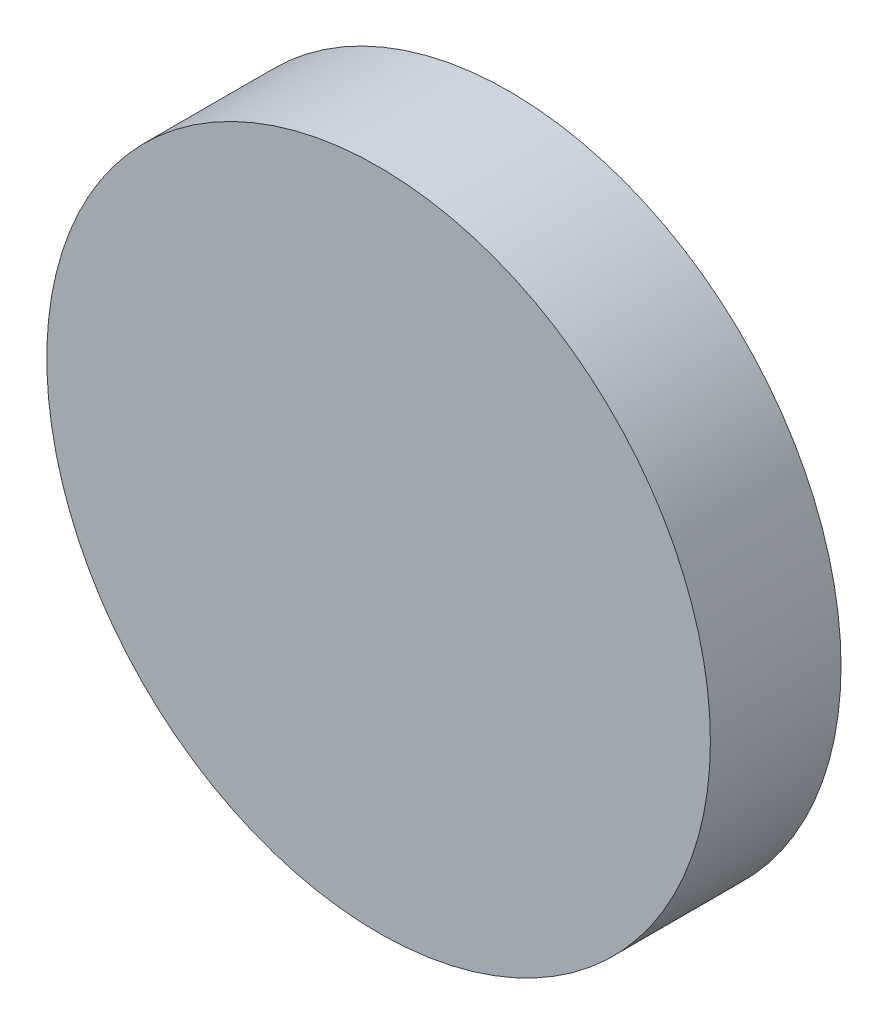
ISO-10303-21;
HEADER;
FILE_DESCRIPTION(('STEP AP214'),'2;1');
FILE_NAME('part.step','',(''),(''),'','','');
FILE_SCHEMA(('AUTOMOTIVE_DESIGN { 1 0 10303 214 1 1 1 1 }'));
ENDSEC;
DATA;
#1=APPLICATION_CONTEXT('core data for automotive mechanical design processes');
#2=APPLICATION_PROTOCOL_DEFINITION('international standard','automotive_design',2000,#1);
#3=PRODUCT_CONTEXT('',#1,'mechanical');
#4=PRODUCT('Part','Part','',(#3));
#5=PRODUCT_RELATED_PRODUCT_CATEGORY('part','',(#4));
#6=PRODUCT_DEFINITION_FORMATION('','',#4);
#7=PRODUCT_DEFINITION_CONTEXT('part definition',#1,'design');
#8=PRODUCT_DEFINITION('design','',#6,#7);
#9=PRODUCT_DEFINITION_SHAPE('','',#8);
#10=(LENGTH_UNIT() NAMED_UNIT(*) SI_UNIT(.MILLI.,.METRE.));
#11=(NAMED_UNIT(*) PLANE_ANGLE_UNIT() SI_UNIT($,.RADIAN.));
#12=(NAMED_UNIT(*) SI_UNIT($,.STERADIAN.) SOLID_ANGLE_UNIT());
#13=UNCERTAINTY_MEASURE_WITH_UNIT(LENGTH_MEASURE(1.E-05),#10,'distance_accuracy_value','');
#14=(GEOMETRIC_REPRESENTATION_CONTEXT(3) GLOBAL_UNCERTAINTY_ASSIGNED_CONTEXT((#13)) GLOBAL_UNIT_ASSIGNED_CONTEXT((#10,
#11,#12)) REPRESENTATION_CONTEXT('',''));
#15=CARTESIAN_POINT('',(0.,0.,0.));
#16=DIRECTION('',(0.,0.,1.));
#17=DIRECTION('',(1.,0.,0.));
#18=AXIS2_PLACEMENT_3D('',#15,#16,#17);
#19=CARTESIAN_POINT('',(0.,0.,10.));
#20=DIRECTION('',(0.,0.,-1.));
#21=DIRECTION('',(-1.,0.,0.));
#22=AXIS2_PLACEMENT_3D('',#19,#20,#21);
#23=CYLINDRICAL_SURFACE('',#22,25.4);
#24=CARTESIAN_POINT('',(0.,0.,10.));
#25=DIRECTION('',(0.,0.,1.));
#26=DIRECTION('',(1.,0.,0.));
#27=AXIS2_PLACEMENT_3D('',#24,#25,#26);
#28=CIRCLE('',#27,25.4);
#29=CARTESIAN_POINT('',(25.4,0.,10.));
#30=VERTEX_POINT('',#29);
#31=EDGE_CURVE('E10',#30,#30,#28,.T.);
#32=ORIENTED_EDGE('',*,*,#31,.F.);
#33=EDGE_LOOP('',(#32));
#34=FACE_BOUND('',#33,.T.);
#35=CARTESIAN_POINT('',(0.,0.,0.));
#36=DIRECTION('',(0.,0.,1.));
#37=DIRECTION('',(1.,0.,0.));
#38=AXIS2_PLACEMENT_3D('',#35,#36,#37);
#39=CIRCLE('',#38,25.4);
#40=CARTESIAN_POINT('',(25.4,0.,0.));
#41=VERTEX_POINT('',#40);
#42=EDGE_CURVE('E38',#41,#41,#39,.T.);
#43=ORIENTED_EDGE('',*,*,#42,.T.);
#44=EDGE_LOOP('',(#43));
#45=FACE_BOUND('',#44,.T.);
#46=ADVANCED_FACE('F35',(#34,#45),#23,.T.);
#47=CARTESIAN_POINT('',(0.,0.,10.));
#48=DIRECTION('',(0.,0.,1.));
#49=DIRECTION('',(1.,0.,0.));
#50=AXIS2_PLACEMENT_3D('',#47,#48,#49);
#51=PLANE('',#50);
#52=ORIENTED_EDGE('',*,*,#31,.T.);
#53=EDGE_LOOP('',(#52));
#54=FACE_BOUND('',#53,.T.);
#55=ADVANCED_FACE('F50',(#54),#51,.T.);
#56=CARTESIAN_POINT('',(0.,0.,0.));
#57=DIRECTION('',(0.,0.,1.));
#58=DIRECTION('',(1.,0.,0.));
#59=AXIS2_PLACEMENT_3D('',#56,#57,#58);
#60=PLANE('',#59);
#61=ORIENTED_EDGE('',*,*,#42,.F.);
#62=EDGE_LOOP('',(#61));
#63=FACE_BOUND('',#62,.T.);
#64=ADVANCED_FACE('F48',(#63),#60,.F.);
#65=CLOSED_SHELL('',(#46,#55,#64));
#66=MANIFOLD_SOLID_BREP('B2',#65);
#67=ADVANCED_BREP_SHAPE_REPRESENTATION('',(#18,#66),#14);
#68=SHAPE_DEFINITION_REPRESENTATION(#9,#67);
ENDSEC;
END-ISO-10303-21;
